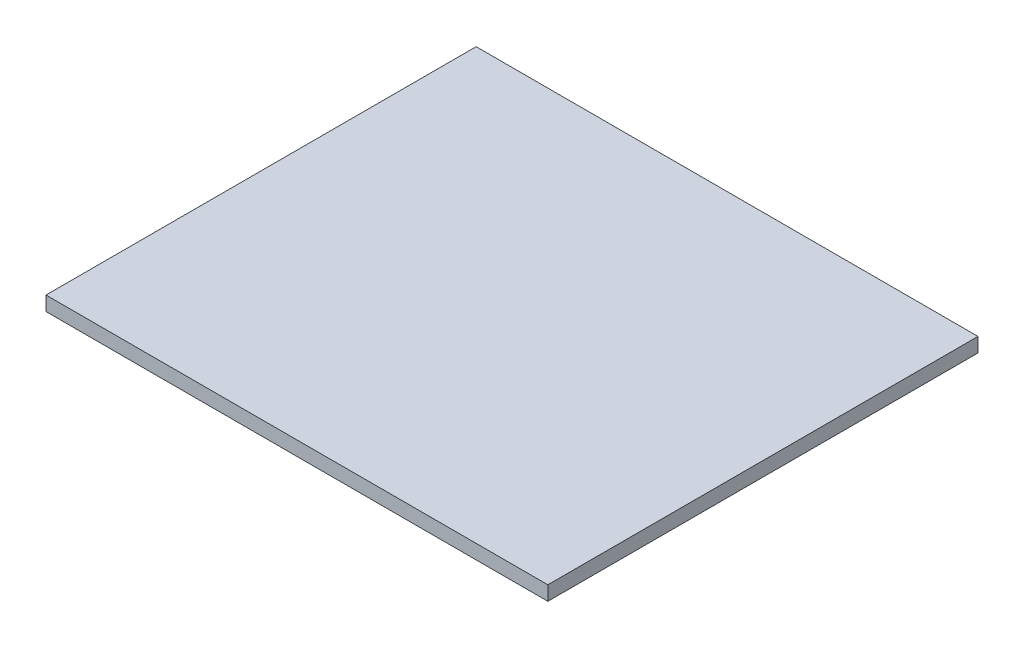
ISO-10303-21;
HEADER;
FILE_DESCRIPTION(('STEP AP214'),'2;1');
FILE_NAME('part.step','',(''),(''),'','','');
FILE_SCHEMA(('AUTOMOTIVE_DESIGN { 1 0 10303 214 1 1 1 1 }'));
ENDSEC;
DATA;
#1=APPLICATION_CONTEXT('core data for automotive mechanical design processes');
#2=APPLICATION_PROTOCOL_DEFINITION('international standard','automotive_design',2000,#1);
#3=PRODUCT_CONTEXT('',#1,'mechanical');
#4=PRODUCT('Part','Part','',(#3));
#5=PRODUCT_RELATED_PRODUCT_CATEGORY('part','',(#4));
#6=PRODUCT_DEFINITION_FORMATION('','',#4);
#7=PRODUCT_DEFINITION_CONTEXT('part definition',#1,'design');
#8=PRODUCT_DEFINITION('design','',#6,#7);
#9=PRODUCT_DEFINITION_SHAPE('','',#8);
#10=(LENGTH_UNIT() NAMED_UNIT(*) SI_UNIT(.MILLI.,.METRE.));
#11=(NAMED_UNIT(*) PLANE_ANGLE_UNIT() SI_UNIT($,.RADIAN.));
#12=(NAMED_UNIT(*) SI_UNIT($,.STERADIAN.) SOLID_ANGLE_UNIT());
#13=UNCERTAINTY_MEASURE_WITH_UNIT(LENGTH_MEASURE(1.E-05),#10,'distance_accuracy_value','');
#14=(GEOMETRIC_REPRESENTATION_CONTEXT(3) GLOBAL_UNCERTAINTY_ASSIGNED_CONTEXT((#13)) GLOBAL_UNIT_ASSIGNED_CONTEXT((#10,
#11,#12)) REPRESENTATION_CONTEXT('',''));
#15=CARTESIAN_POINT('',(0.,0.,0.));
#16=DIRECTION('',(0.,0.,1.));
#17=DIRECTION('',(1.,0.,0.));
#18=AXIS2_PLACEMENT_3D('',#15,#16,#17);
#19=CARTESIAN_POINT('',(16.8934585598946,1.6,-23.7593013676059));
#20=DIRECTION('',(1.,0.,0.));
#21=DIRECTION('',(0.,0.,-1.));
#22=AXIS2_PLACEMENT_3D('',#19,#20,#21);
#23=PLANE('',#22);
#24=DIRECTION('',(0.,0.,1.));
#25=VECTOR('',#24,1.);
#26=CARTESIAN_POINT('',(16.8934585598946,0.,-23.7593013676059));
#27=LINE('',#26,#25);
#28=CARTESIAN_POINT('',(16.8934585598946,0.,-23.7593013676059));
#29=VERTEX_POINT('',#28);
#30=CARTESIAN_POINT('',(16.8934585598946,0.,24.2406986323941));
#31=VERTEX_POINT('',#30);
#32=EDGE_CURVE('E116',#29,#31,#27,.T.);
#33=ORIENTED_EDGE('',*,*,#32,.F.);
#34=DIRECTION('',(0.,-1.,0.));
#35=VECTOR('',#34,1.);
#36=CARTESIAN_POINT('',(16.8934585598946,1.6,-23.7593013676059));
#37=LINE('',#36,#35);
#38=CARTESIAN_POINT('',(16.8934585598946,1.6,-23.7593013676059));
#39=VERTEX_POINT('',#38);
#40=EDGE_CURVE('E11',#39,#29,#37,.T.);
#41=ORIENTED_EDGE('',*,*,#40,.F.);
#42=DIRECTION('',(0.,0.,1.));
#43=VECTOR('',#42,1.);
#44=CARTESIAN_POINT('',(16.8934585598946,1.6,-23.7593013676059));
#45=LINE('',#44,#43);
#46=CARTESIAN_POINT('',(16.8934585598946,1.6,24.2406986323941));
#47=VERTEX_POINT('',#46);
#48=EDGE_CURVE('E109',#39,#47,#45,.T.);
#49=ORIENTED_EDGE('',*,*,#48,.T.);
#50=DIRECTION('',(0.,-1.,0.));
#51=VECTOR('',#50,1.);
#52=CARTESIAN_POINT('',(16.8934585598946,1.6,24.2406986323941));
#53=LINE('',#52,#51);
#54=EDGE_CURVE('E48',#47,#31,#53,.T.);
#55=ORIENTED_EDGE('',*,*,#54,.T.);
#56=EDGE_LOOP('',(#33,#41,#49,#55));
#57=FACE_BOUND('',#56,.T.);
#58=ADVANCED_FACE('F45',(#57),#23,.T.);
#59=CARTESIAN_POINT('',(16.8934585598946,1.6,-23.7593013676059));
#60=DIRECTION('',(0.,0.,1.));
#61=DIRECTION('',(1.,0.,0.));
#62=AXIS2_PLACEMENT_3D('',#59,#60,#61);
#63=PLANE('',#62);
#64=DIRECTION('',(-1.,0.,0.));
#65=VECTOR('',#64,1.);
#66=CARTESIAN_POINT('',(16.8934585598946,0.,-23.7593013676059));
#67=LINE('',#66,#65);
#68=CARTESIAN_POINT('',(-39.1065414401054,0.,-23.7593013676059));
#69=VERTEX_POINT('',#68);
#70=EDGE_CURVE('E79',#29,#69,#67,.T.);
#71=ORIENTED_EDGE('',*,*,#70,.T.);
#72=DIRECTION('',(0.,-1.,0.));
#73=VECTOR('',#72,1.);
#74=CARTESIAN_POINT('',(-39.1065414401054,1.6,-23.7593013676059));
#75=LINE('',#74,#73);
#76=CARTESIAN_POINT('',(-39.1065414401054,1.6,-23.7593013676059));
#77=VERTEX_POINT('',#76);
#78=EDGE_CURVE('E55',#77,#69,#75,.T.);
#79=ORIENTED_EDGE('',*,*,#78,.F.);
#80=DIRECTION('',(-1.,0.,0.));
#81=VECTOR('',#80,1.);
#82=CARTESIAN_POINT('',(16.8934585598946,1.6,-23.7593013676059));
#83=LINE('',#82,#81);
#84=EDGE_CURVE('E96',#39,#77,#83,.T.);
#85=ORIENTED_EDGE('',*,*,#84,.F.);
#86=ORIENTED_EDGE('',*,*,#40,.T.);
#87=EDGE_LOOP('',(#71,#79,#85,#86));
#88=FACE_BOUND('',#87,.T.);
#89=ADVANCED_FACE('F132',(#88),#63,.F.);
#90=CARTESIAN_POINT('',(-39.1065414401054,1.6,-23.7593013676059));
#91=DIRECTION('',(1.,0.,0.));
#92=DIRECTION('',(0.,0.,-1.));
#93=AXIS2_PLACEMENT_3D('',#90,#91,#92);
#94=PLANE('',#93);
#95=DIRECTION('',(0.,0.,1.));
#96=VECTOR('',#95,1.);
#97=CARTESIAN_POINT('',(-39.1065414401054,0.,-23.7593013676059));
#98=LINE('',#97,#96);
#99=CARTESIAN_POINT('',(-39.1065414401054,0.,24.2406986323941));
#100=VERTEX_POINT('',#99);
#101=EDGE_CURVE('E104',#69,#100,#98,.T.);
#102=ORIENTED_EDGE('',*,*,#101,.T.);
#103=DIRECTION('',(0.,-1.,0.));
#104=VECTOR('',#103,1.);
#105=CARTESIAN_POINT('',(-39.1065414401054,1.6,24.2406986323941));
#106=LINE('',#105,#104);
#107=CARTESIAN_POINT('',(-39.1065414401054,1.6,24.2406986323941));
#108=VERTEX_POINT('',#107);
#109=EDGE_CURVE('E101',#108,#100,#106,.T.);
#110=ORIENTED_EDGE('',*,*,#109,.F.);
#111=DIRECTION('',(0.,0.,1.));
#112=VECTOR('',#111,1.);
#113=CARTESIAN_POINT('',(-39.1065414401054,1.6,-23.7593013676059));
#114=LINE('',#113,#112);
#115=EDGE_CURVE('E91',#77,#108,#114,.T.);
#116=ORIENTED_EDGE('',*,*,#115,.F.);
#117=ORIENTED_EDGE('',*,*,#78,.T.);
#118=EDGE_LOOP('',(#102,#110,#116,#117));
#119=FACE_BOUND('',#118,.T.);
#120=ADVANCED_FACE('F102',(#119),#94,.F.);
#121=CARTESIAN_POINT('',(16.8934585598946,1.6,24.2406986323941));
#122=DIRECTION('',(0.,0.,1.));
#123=DIRECTION('',(1.,0.,0.));
#124=AXIS2_PLACEMENT_3D('',#121,#122,#123);
#125=PLANE('',#124);
#126=DIRECTION('',(-1.,0.,0.));
#127=VECTOR('',#126,1.);
#128=CARTESIAN_POINT('',(16.8934585598946,0.,24.2406986323941));
#129=LINE('',#128,#127);
#130=EDGE_CURVE('E120',#31,#100,#129,.T.);
#131=ORIENTED_EDGE('',*,*,#130,.F.);
#132=ORIENTED_EDGE('',*,*,#54,.F.);
#133=DIRECTION('',(-1.,0.,0.));
#134=VECTOR('',#133,1.);
#135=CARTESIAN_POINT('',(16.8934585598946,1.6,24.2406986323941));
#136=LINE('',#135,#134);
#137=EDGE_CURVE('E95',#47,#108,#136,.T.);
#138=ORIENTED_EDGE('',*,*,#137,.T.);
#139=ORIENTED_EDGE('',*,*,#109,.T.);
#140=EDGE_LOOP('',(#131,#132,#138,#139));
#141=FACE_BOUND('',#140,.T.);
#142=ADVANCED_FACE('F107',(#141),#125,.T.);
#143=CARTESIAN_POINT('',(0.,1.6,0.));
#144=DIRECTION('',(0.,-1.,0.));
#145=DIRECTION('',(0.,0.,-1.));
#146=AXIS2_PLACEMENT_3D('',#143,#144,#145);
#147=PLANE('',#146);
#148=ORIENTED_EDGE('',*,*,#48,.F.);
#149=ORIENTED_EDGE('',*,*,#84,.T.);
#150=ORIENTED_EDGE('',*,*,#115,.T.);
#151=ORIENTED_EDGE('',*,*,#137,.F.);
#152=EDGE_LOOP('',(#148,#149,#150,#151));
#153=FACE_BOUND('',#152,.T.);
#154=ADVANCED_FACE('F94',(#153),#147,.F.);
#155=CARTESIAN_POINT('',(0.,0.,0.));
#156=DIRECTION('',(0.,-1.,0.));
#157=DIRECTION('',(0.,0.,-1.));
#158=AXIS2_PLACEMENT_3D('',#155,#156,#157);
#159=PLANE('',#158);
#160=ORIENTED_EDGE('',*,*,#32,.T.);
#161=ORIENTED_EDGE('',*,*,#130,.T.);
#162=ORIENTED_EDGE('',*,*,#101,.F.);
#163=ORIENTED_EDGE('',*,*,#70,.F.);
#164=EDGE_LOOP('',(#160,#161,#162,#163));
#165=FACE_BOUND('',#164,.T.);
#166=ADVANCED_FACE('F129',(#165),#159,.T.);
#167=CLOSED_SHELL('',(#58,#89,#120,#142,#154,#166));
#168=MANIFOLD_SOLID_BREP('B2',#167);
#169=ADVANCED_BREP_SHAPE_REPRESENTATION('',(#18,#168),#14);
#170=SHAPE_DEFINITION_REPRESENTATION(#9,#169);
ENDSEC;
END-ISO-10303-21;
